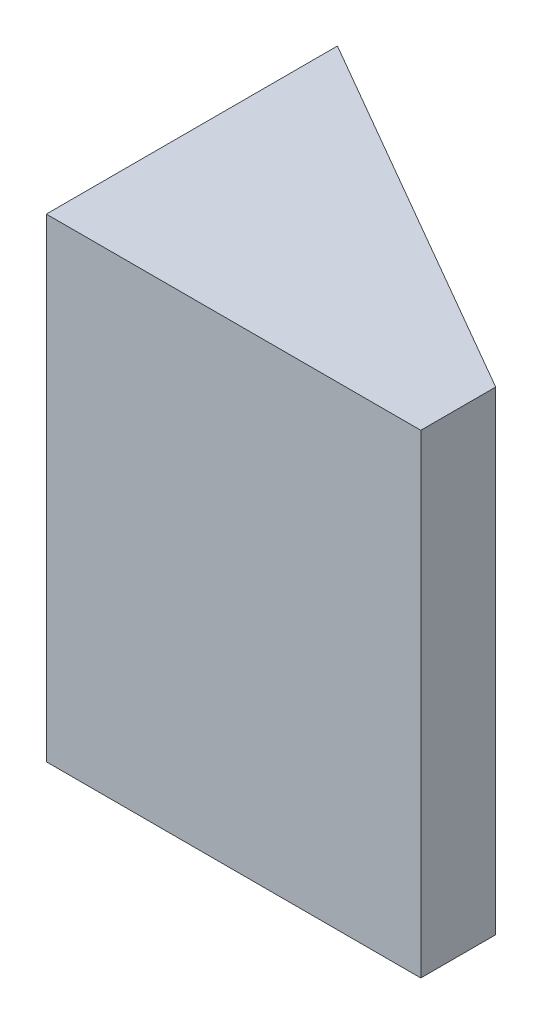
ISO-10303-21;
HEADER;
FILE_DESCRIPTION(('STEP AP214'),'2;1');
FILE_NAME('part.step','',(''),(''),'','','');
FILE_SCHEMA(('AUTOMOTIVE_DESIGN { 1 0 10303 214 1 1 1 1 }'));
ENDSEC;
DATA;
#1=APPLICATION_CONTEXT('core data for automotive mechanical design processes');
#2=APPLICATION_PROTOCOL_DEFINITION('international standard','automotive_design',2000,#1);
#3=PRODUCT_CONTEXT('',#1,'mechanical');
#4=PRODUCT('Part','Part','',(#3));
#5=PRODUCT_RELATED_PRODUCT_CATEGORY('part','',(#4));
#6=PRODUCT_DEFINITION_FORMATION('','',#4);
#7=PRODUCT_DEFINITION_CONTEXT('part definition',#1,'design');
#8=PRODUCT_DEFINITION('design','',#6,#7);
#9=PRODUCT_DEFINITION_SHAPE('','',#8);
#10=(LENGTH_UNIT() NAMED_UNIT(*) SI_UNIT(.MILLI.,.METRE.));
#11=(NAMED_UNIT(*) PLANE_ANGLE_UNIT() SI_UNIT($,.RADIAN.));
#12=(NAMED_UNIT(*) SI_UNIT($,.STERADIAN.) SOLID_ANGLE_UNIT());
#13=UNCERTAINTY_MEASURE_WITH_UNIT(LENGTH_MEASURE(1.E-05),#10,'distance_accuracy_value','');
#14=(GEOMETRIC_REPRESENTATION_CONTEXT(3) GLOBAL_UNCERTAINTY_ASSIGNED_CONTEXT((#13)) GLOBAL_UNIT_ASSIGNED_CONTEXT((#10,
#11,#12)) REPRESENTATION_CONTEXT('',''));
#15=CARTESIAN_POINT('',(0.,0.,0.));
#16=DIRECTION('',(0.,0.,1.));
#17=DIRECTION('',(1.,0.,0.));
#18=AXIS2_PLACEMENT_3D('',#15,#16,#17);
#19=CARTESIAN_POINT('',(7.5,-9.5,3.));
#20=DIRECTION('',(-1.,0.,0.));
#21=DIRECTION('',(0.,0.,1.));
#22=AXIS2_PLACEMENT_3D('',#19,#20,#21);
#23=PLANE('',#22);
#24=DIRECTION('',(0.,1.,0.));
#25=VECTOR('',#24,1.);
#26=CARTESIAN_POINT('',(7.5,-9.5,0.));
#27=LINE('',#26,#25);
#28=CARTESIAN_POINT('',(7.5,-9.5,0.));
#29=VERTEX_POINT('',#28);
#30=CARTESIAN_POINT('',(7.5,9.5,0.));
#31=VERTEX_POINT('',#30);
#32=EDGE_CURVE('E73',#29,#31,#27,.T.);
#33=ORIENTED_EDGE('',*,*,#32,.T.);
#34=DIRECTION('',(0.,0.,-1.));
#35=VECTOR('',#34,1.);
#36=CARTESIAN_POINT('',(7.5,9.5,3.));
#37=LINE('',#36,#35);
#38=CARTESIAN_POINT('',(7.5,9.5,3.));
#39=VERTEX_POINT('',#38);
#40=EDGE_CURVE('E11',#39,#31,#37,.T.);
#41=ORIENTED_EDGE('',*,*,#40,.F.);
#42=DIRECTION('',(0.,1.,0.));
#43=VECTOR('',#42,1.);
#44=CARTESIAN_POINT('',(7.5,-9.5,3.));
#45=LINE('',#44,#43);
#46=CARTESIAN_POINT('',(7.5,-9.5,3.));
#47=VERTEX_POINT('',#46);
#48=EDGE_CURVE('E83',#47,#39,#45,.T.);
#49=ORIENTED_EDGE('',*,*,#48,.F.);
#50=DIRECTION('',(0.,0.,-1.));
#51=VECTOR('',#50,1.);
#52=CARTESIAN_POINT('',(7.5,-9.5,3.));
#53=LINE('',#52,#51);
#54=EDGE_CURVE('E88',#47,#29,#53,.T.);
#55=ORIENTED_EDGE('',*,*,#54,.T.);
#56=EDGE_LOOP('',(#33,#41,#49,#55));
#57=FACE_BOUND('',#56,.T.);
#58=ADVANCED_FACE('F33',(#57),#23,.F.);
#59=CARTESIAN_POINT('',(-7.5,9.5,3.));
#60=DIRECTION('',(0.,-1.,0.));
#61=DIRECTION('',(0.,0.,-1.));
#62=AXIS2_PLACEMENT_3D('',#59,#60,#61);
#63=PLANE('',#62);
#64=ORIENTED_EDGE('',*,*,#40,.T.);
#65=DIRECTION('',(-0.866025403784442,0.,-0.499999999999995));
#66=VECTOR('',#65,1.);
#67=CARTESIAN_POINT('',(-7.5,9.5,-8.66025403784426));
#68=LINE('',#67,#66);
#69=CARTESIAN_POINT('',(-7.5,9.5,-8.66025403784426));
#70=VERTEX_POINT('',#69);
#71=EDGE_CURVE('E79',#31,#70,#68,.T.);
#72=ORIENTED_EDGE('',*,*,#71,.T.);
#73=DIRECTION('',(0.,0.,-1.));
#74=VECTOR('',#73,1.);
#75=CARTESIAN_POINT('',(-7.5,9.5,3.));
#76=LINE('',#75,#74);
#77=CARTESIAN_POINT('',(-7.5,9.5,3.));
#78=VERTEX_POINT('',#77);
#79=EDGE_CURVE('E40',#78,#70,#76,.T.);
#80=ORIENTED_EDGE('',*,*,#79,.F.);
#81=DIRECTION('',(-1.,0.,0.));
#82=VECTOR('',#81,1.);
#83=CARTESIAN_POINT('',(-7.5,9.5,3.));
#84=LINE('',#83,#82);
#85=EDGE_CURVE('E105',#39,#78,#84,.T.);
#86=ORIENTED_EDGE('',*,*,#85,.F.);
#87=EDGE_LOOP('',(#64,#72,#80,#86));
#88=FACE_BOUND('',#87,.T.);
#89=ADVANCED_FACE('F101',(#88),#63,.F.);
#90=CARTESIAN_POINT('',(-7.5,-9.5,3.));
#91=DIRECTION('',(1.,0.,0.));
#92=DIRECTION('',(0.,0.,-1.));
#93=AXIS2_PLACEMENT_3D('',#90,#91,#92);
#94=PLANE('',#93);
#95=ORIENTED_EDGE('',*,*,#79,.T.);
#96=DIRECTION('',(0.,1.,0.));
#97=VECTOR('',#96,1.);
#98=CARTESIAN_POINT('',(-7.5,-9.5,-8.66025403784426));
#99=LINE('',#98,#97);
#100=CARTESIAN_POINT('',(-7.5,-9.5,-8.66025403784426));
#101=VERTEX_POINT('',#100);
#102=EDGE_CURVE('E84',#101,#70,#99,.T.);
#103=ORIENTED_EDGE('',*,*,#102,.F.);
#104=DIRECTION('',(0.,0.,-1.));
#105=VECTOR('',#104,1.);
#106=CARTESIAN_POINT('',(-7.5,-9.5,3.));
#107=LINE('',#106,#105);
#108=CARTESIAN_POINT('',(-7.5,-9.5,3.));
#109=VERTEX_POINT('',#108);
#110=EDGE_CURVE('E90',#109,#101,#107,.T.);
#111=ORIENTED_EDGE('',*,*,#110,.F.);
#112=DIRECTION('',(0.,-1.,0.));
#113=VECTOR('',#112,1.);
#114=CARTESIAN_POINT('',(-7.5,-9.5,3.));
#115=LINE('',#114,#113);
#116=EDGE_CURVE('E52',#78,#109,#115,.T.);
#117=ORIENTED_EDGE('',*,*,#116,.F.);
#118=EDGE_LOOP('',(#95,#103,#111,#117));
#119=FACE_BOUND('',#118,.T.);
#120=ADVANCED_FACE('F98',(#119),#94,.F.);
#121=CARTESIAN_POINT('',(-7.5,-9.5,3.));
#122=DIRECTION('',(0.,1.,0.));
#123=DIRECTION('',(0.,0.,1.));
#124=AXIS2_PLACEMENT_3D('',#121,#122,#123);
#125=PLANE('',#124);
#126=ORIENTED_EDGE('',*,*,#110,.T.);
#127=DIRECTION('',(-0.866025403784442,0.,-0.499999999999995));
#128=VECTOR('',#127,1.);
#129=CARTESIAN_POINT('',(-7.5,-9.5,-8.66025403784426));
#130=LINE('',#129,#128);
#131=EDGE_CURVE('E77',#29,#101,#130,.T.);
#132=ORIENTED_EDGE('',*,*,#131,.F.);
#133=ORIENTED_EDGE('',*,*,#54,.F.);
#134=DIRECTION('',(1.,0.,0.));
#135=VECTOR('',#134,1.);
#136=CARTESIAN_POINT('',(-7.5,-9.5,3.));
#137=LINE('',#136,#135);
#138=EDGE_CURVE('E47',#109,#47,#137,.T.);
#139=ORIENTED_EDGE('',*,*,#138,.F.);
#140=EDGE_LOOP('',(#126,#132,#133,#139));
#141=FACE_BOUND('',#140,.T.);
#142=ADVANCED_FACE('F87',(#141),#125,.F.);
#143=CARTESIAN_POINT('',(0.,0.,3.));
#144=DIRECTION('',(0.,0.,-1.));
#145=DIRECTION('',(-1.,0.,0.));
#146=AXIS2_PLACEMENT_3D('',#143,#144,#145);
#147=PLANE('',#146);
#148=ORIENTED_EDGE('',*,*,#48,.T.);
#149=ORIENTED_EDGE('',*,*,#85,.T.);
#150=ORIENTED_EDGE('',*,*,#116,.T.);
#151=ORIENTED_EDGE('',*,*,#138,.T.);
#152=EDGE_LOOP('',(#148,#149,#150,#151));
#153=FACE_BOUND('',#152,.T.);
#154=ADVANCED_FACE('F107',(#153),#147,.F.);
#155=CARTESIAN_POINT('',(-7.5,-9.5,-8.66025403784426));
#156=DIRECTION('',(0.499999999999995,0.,-0.866025403784442));
#157=DIRECTION('',(-0.866025403784442,0.,-0.499999999999995));
#158=AXIS2_PLACEMENT_3D('',#155,#156,#157);
#159=PLANE('',#158);
#160=ORIENTED_EDGE('',*,*,#71,.F.);
#161=ORIENTED_EDGE('',*,*,#32,.F.);
#162=ORIENTED_EDGE('',*,*,#131,.T.);
#163=ORIENTED_EDGE('',*,*,#102,.T.);
#164=EDGE_LOOP('',(#160,#161,#162,#163));
#165=FACE_BOUND('',#164,.T.);
#166=ADVANCED_FACE('F75',(#165),#159,.T.);
#167=CLOSED_SHELL('',(#58,#89,#120,#142,#154,#166));
#168=MANIFOLD_SOLID_BREP('B2',#167);
#169=ADVANCED_BREP_SHAPE_REPRESENTATION('',(#18,#168),#14);
#170=SHAPE_DEFINITION_REPRESENTATION(#9,#169);
ENDSEC;
END-ISO-10303-21;
